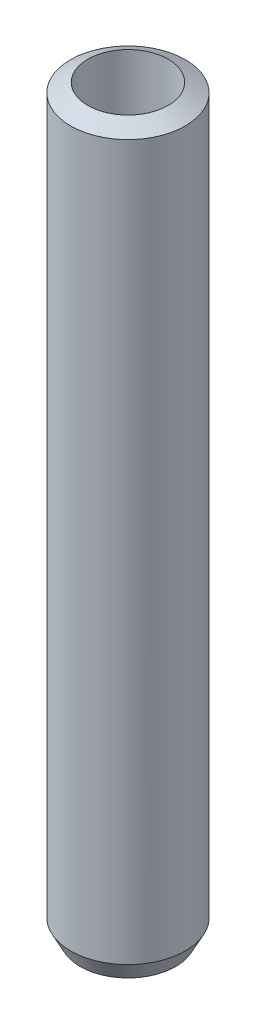
ISO-10303-21;
HEADER;
FILE_DESCRIPTION(('STEP AP214'),'2;1');
FILE_NAME('part.step','',(''),(''),'','','');
FILE_SCHEMA(('AUTOMOTIVE_DESIGN { 1 0 10303 214 1 1 1 1 }'));
ENDSEC;
DATA;
#1=APPLICATION_CONTEXT('core data for automotive mechanical design processes');
#2=APPLICATION_PROTOCOL_DEFINITION('international standard','automotive_design',2000,#1);
#3=PRODUCT_CONTEXT('',#1,'mechanical');
#4=PRODUCT('Part','Part','',(#3));
#5=PRODUCT_RELATED_PRODUCT_CATEGORY('part','',(#4));
#6=PRODUCT_DEFINITION_FORMATION('','',#4);
#7=PRODUCT_DEFINITION_CONTEXT('part definition',#1,'design');
#8=PRODUCT_DEFINITION('design','',#6,#7);
#9=PRODUCT_DEFINITION_SHAPE('','',#8);
#10=(LENGTH_UNIT() NAMED_UNIT(*) SI_UNIT(.MILLI.,.METRE.));
#11=(NAMED_UNIT(*) PLANE_ANGLE_UNIT() SI_UNIT($,.RADIAN.));
#12=(NAMED_UNIT(*) SI_UNIT($,.STERADIAN.) SOLID_ANGLE_UNIT());
#13=UNCERTAINTY_MEASURE_WITH_UNIT(LENGTH_MEASURE(1.E-05),#10,'distance_accuracy_value','');
#14=(GEOMETRIC_REPRESENTATION_CONTEXT(3) GLOBAL_UNCERTAINTY_ASSIGNED_CONTEXT((#13)) GLOBAL_UNIT_ASSIGNED_CONTEXT((#10,
#11,#12)) REPRESENTATION_CONTEXT('',''));
#15=CARTESIAN_POINT('',(0.,0.,0.));
#16=DIRECTION('',(0.,0.,1.));
#17=DIRECTION('',(1.,0.,0.));
#18=AXIS2_PLACEMENT_3D('',#15,#16,#17);
#19=CARTESIAN_POINT('',(0.,258.769668611117,0.));
#20=DIRECTION('',(0.,-1.,0.));
#21=DIRECTION('',(0.,0.,-1.));
#22=AXIS2_PLACEMENT_3D('',#19,#20,#21);
#23=CYLINDRICAL_SURFACE('',#22,20.);
#24=CARTESIAN_POINT('',(0.,255.397265597228,0.));
#25=DIRECTION('',(0.,1.,0.));
#26=DIRECTION('',(0.,0.,1.));
#27=AXIS2_PLACEMENT_3D('',#24,#25,#26);
#28=CIRCLE('',#27,20.);
#29=CARTESIAN_POINT('',(0.,255.397265597228,20.));
#30=VERTEX_POINT('',#29);
#31=EDGE_CURVE('E50',#30,#30,#28,.F.);
#32=ORIENTED_EDGE('',*,*,#31,.T.);
#33=EDGE_LOOP('',(#32));
#34=FACE_BOUND('',#33,.T.);
#35=CARTESIAN_POINT('',(0.,6.42443127760828,0.));
#36=DIRECTION('',(0.,1.,0.));
#37=DIRECTION('',(0.,0.,1.));
#38=AXIS2_PLACEMENT_3D('',#35,#36,#37);
#39=CIRCLE('',#38,20.);
#40=CARTESIAN_POINT('',(0.,6.42443127760828,20.));
#41=VERTEX_POINT('',#40);
#42=EDGE_CURVE('E51',#41,#41,#39,.T.);
#43=ORIENTED_EDGE('',*,*,#42,.T.);
#44=EDGE_LOOP('',(#43));
#45=FACE_BOUND('',#44,.T.);
#46=ADVANCED_FACE('F39',(#34,#45),#23,.T.);
#47=CARTESIAN_POINT('',(0.,0.,0.));
#48=DIRECTION('',(0.,1.,0.));
#49=DIRECTION('',(0.,0.,1.));
#50=AXIS2_PLACEMENT_3D('',#47,#48,#49);
#51=PLANE('',#50);
#52=CARTESIAN_POINT('',(0.,0.,0.));
#53=DIRECTION('',(0.,1.,0.));
#54=DIRECTION('',(0.,0.,1.));
#55=AXIS2_PLACEMENT_3D('',#52,#53,#54);
#56=CIRCLE('',#55,16.6275969861112);
#57=CARTESIAN_POINT('',(0.,0.,16.6275969861112));
#58=VERTEX_POINT('',#57);
#59=EDGE_CURVE('E10',#58,#58,#56,.F.);
#60=ORIENTED_EDGE('',*,*,#59,.T.);
#61=EDGE_LOOP('',(#60));
#62=FACE_BOUND('',#61,.T.);
#63=CARTESIAN_POINT('',(0.,0.,0.));
#64=DIRECTION('',(0.,1.,0.));
#65=DIRECTION('',(0.,0.,1.));
#66=AXIS2_PLACEMENT_3D('',#63,#64,#65);
#67=CIRCLE('',#66,13.9871527708189);
#68=CARTESIAN_POINT('',(0.,0.,13.9871527708189));
#69=VERTEX_POINT('',#68);
#70=EDGE_CURVE('E58',#69,#69,#67,.T.);
#71=ORIENTED_EDGE('',*,*,#70,.T.);
#72=EDGE_LOOP('',(#71));
#73=FACE_BOUND('',#72,.T.);
#74=ADVANCED_FACE('F62',(#62,#73),#51,.F.);
#75=CARTESIAN_POINT('',(0.,258.769668611117,0.));
#76=DIRECTION('',(0.,-1.,0.));
#77=DIRECTION('',(0.,0.,-1.));
#78=AXIS2_PLACEMENT_3D('',#75,#76,#77);
#79=CYLINDRICAL_SURFACE('',#78,13.9871527708189);
#80=CARTESIAN_POINT('',(0.,258.553614111442,0.));
#81=DIRECTION('',(0.,-1.,0.));
#82=DIRECTION('',(0.,0.,-1.));
#83=AXIS2_PLACEMENT_3D('',#80,#81,#82);
#84=CIRCLE('',#83,13.9871527708189);
#85=CARTESIAN_POINT('',(0.,258.553614111442,-13.9871527708189));
#86=VERTEX_POINT('',#85);
#87=EDGE_CURVE('E54',#86,#86,#84,.F.);
#88=ORIENTED_EDGE('',*,*,#87,.T.);
#89=EDGE_LOOP('',(#88));
#90=FACE_BOUND('',#89,.T.);
#91=ORIENTED_EDGE('',*,*,#70,.F.);
#92=EDGE_LOOP('',(#91));
#93=FACE_BOUND('',#92,.T.);
#94=ADVANCED_FACE('F68',(#90,#93),#79,.F.);
#95=CARTESIAN_POINT('',(0.,258.769668611117,0.));
#96=DIRECTION('',(0.,-1.,0.));
#97=DIRECTION('',(0.,0.,-1.));
#98=AXIS2_PLACEMENT_3D('',#95,#96,#97);
#99=CONICAL_SURFACE('',#98,13.5755687223915,1.08740099207424);
#100=ORIENTED_EDGE('',*,*,#31,.F.);
#101=EDGE_LOOP('',(#100));
#102=FACE_BOUND('',#101,.T.);
#103=ORIENTED_EDGE('',*,*,#87,.F.);
#104=EDGE_LOOP('',(#103));
#105=FACE_BOUND('',#104,.T.);
#106=ADVANCED_FACE('F66',(#102,#105),#99,.T.);
#107=CARTESIAN_POINT('',(0.,6.42443127760828,0.));
#108=DIRECTION('',(0.,1.,0.));
#109=DIRECTION('',(0.,0.,1.));
#110=AXIS2_PLACEMENT_3D('',#107,#108,#109);
#111=CONICAL_SURFACE('',#110,20.,0.483395334720656);
#112=ORIENTED_EDGE('',*,*,#59,.F.);
#113=EDGE_LOOP('',(#112));
#114=FACE_BOUND('',#113,.T.);
#115=ORIENTED_EDGE('',*,*,#42,.F.);
#116=EDGE_LOOP('',(#115));
#117=FACE_BOUND('',#116,.T.);
#118=ADVANCED_FACE('F45',(#114,#117),#111,.T.);
#119=CLOSED_SHELL('',(#46,#74,#94,#106,#118));
#120=MANIFOLD_SOLID_BREP('B2',#119);
#121=ADVANCED_BREP_SHAPE_REPRESENTATION('',(#18,#120),#14);
#122=SHAPE_DEFINITION_REPRESENTATION(#9,#121);
ENDSEC;
END-ISO-10303-21;
